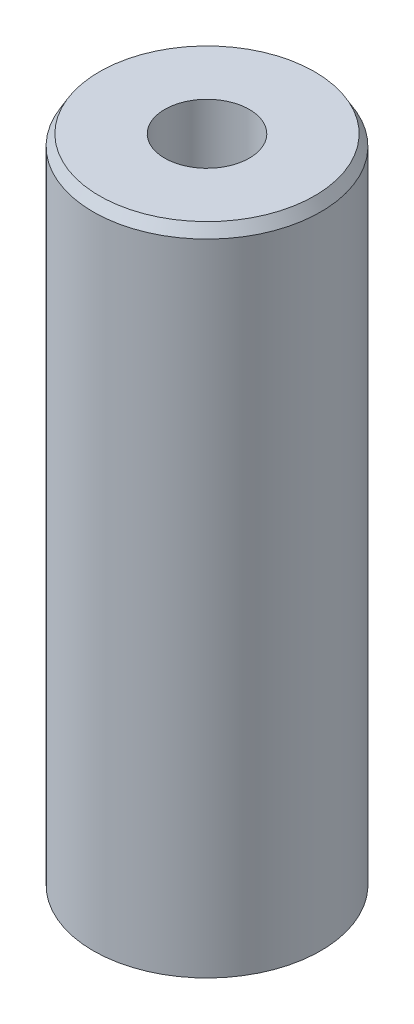
ISO-10303-21;
HEADER;
FILE_DESCRIPTION(('STEP AP214'),'2;1');
FILE_NAME('part.step','',(''),(''),'','','');
FILE_SCHEMA(('AUTOMOTIVE_DESIGN { 1 0 10303 214 1 1 1 1 }'));
ENDSEC;
DATA;
#1=APPLICATION_CONTEXT('core data for automotive mechanical design processes');
#2=APPLICATION_PROTOCOL_DEFINITION('international standard','automotive_design',2000,#1);
#3=PRODUCT_CONTEXT('',#1,'mechanical');
#4=PRODUCT('Part','Part','',(#3));
#5=PRODUCT_RELATED_PRODUCT_CATEGORY('part','',(#4));
#6=PRODUCT_DEFINITION_FORMATION('','',#4);
#7=PRODUCT_DEFINITION_CONTEXT('part definition',#1,'design');
#8=PRODUCT_DEFINITION('design','',#6,#7);
#9=PRODUCT_DEFINITION_SHAPE('','',#8);
#10=(LENGTH_UNIT() NAMED_UNIT(*) SI_UNIT(.MILLI.,.METRE.));
#11=(NAMED_UNIT(*) PLANE_ANGLE_UNIT() SI_UNIT($,.RADIAN.));
#12=(NAMED_UNIT(*) SI_UNIT($,.STERADIAN.) SOLID_ANGLE_UNIT());
#13=UNCERTAINTY_MEASURE_WITH_UNIT(LENGTH_MEASURE(1.E-05),#10,'distance_accuracy_value','');
#14=(GEOMETRIC_REPRESENTATION_CONTEXT(3) GLOBAL_UNCERTAINTY_ASSIGNED_CONTEXT((#13)) GLOBAL_UNIT_ASSIGNED_CONTEXT((#10,
#11,#12)) REPRESENTATION_CONTEXT('',''));
#15=CARTESIAN_POINT('',(0.,0.,0.));
#16=DIRECTION('',(0.,0.,1.));
#17=DIRECTION('',(1.,0.,0.));
#18=AXIS2_PLACEMENT_3D('',#15,#16,#17);
#19=CARTESIAN_POINT('',(0.,202.016611042001,0.));
#20=DIRECTION('',(0.,-1.,0.));
#21=DIRECTION('',(0.,0.,-1.));
#22=AXIS2_PLACEMENT_3D('',#19,#20,#21);
#23=CYLINDRICAL_SURFACE('',#22,35.);
#24=CARTESIAN_POINT('',(0.,198.705183530527,0.));
#25=DIRECTION('',(0.,1.,0.));
#26=DIRECTION('',(0.,0.,1.));
#27=AXIS2_PLACEMENT_3D('',#24,#25,#26);
#28=CIRCLE('',#27,35.);
#29=CARTESIAN_POINT('',(0.,198.705183530527,-35.));
#30=VERTEX_POINT('',#29);
#31=EDGE_CURVE('E50',#30,#30,#28,.F.);
#32=CARTESIAN_POINT('',(0.,1.91185356515172,0.));
#33=DIRECTION('',(0.,1.,0.));
#34=DIRECTION('',(0.,0.,1.));
#35=AXIS2_PLACEMENT_3D('',#32,#33,#34);
#36=CIRCLE('',#35,35.);
#37=CARTESIAN_POINT('',(0.,1.91185356515169,-35.));
#38=VERTEX_POINT('',#37);
#39=EDGE_CURVE('E51',#38,#38,#36,.T.);
#40=CARTESIAN_POINT('',(0.,198.705183530527,-35.));
#41=CARTESIAN_POINT('',(0.,196.655253010054,-35.));
#42=CARTESIAN_POINT('',(0.,194.605322489581,-35.));
#43=CARTESIAN_POINT('',(0.,190.505461448636,-35.));
#44=CARTESIAN_POINT('',(0.,188.455530928163,-35.));
#45=CARTESIAN_POINT('',(0.,184.355669887218,-35.));
#46=CARTESIAN_POINT('',(0.,182.305739366745,-35.));
#47=CARTESIAN_POINT('',(0.,178.2058783258,-35.));
#48=CARTESIAN_POINT('',(0.,176.155947805327,-35.));
#49=CARTESIAN_POINT('',(0.,172.056086764382,-35.));
#50=CARTESIAN_POINT('',(0.,170.006156243909,-35.));
#51=CARTESIAN_POINT('',(0.,165.906295202964,-35.));
#52=CARTESIAN_POINT('',(0.,163.856364682491,-35.));
#53=CARTESIAN_POINT('',(0.,159.756503641546,-35.));
#54=CARTESIAN_POINT('',(0.,157.706573121073,-35.));
#55=CARTESIAN_POINT('',(0.,153.606712080128,-35.));
#56=CARTESIAN_POINT('',(0.,151.556781559655,-35.));
#57=CARTESIAN_POINT('',(0.,147.45692051871,-35.));
#58=CARTESIAN_POINT('',(0.,145.406989998238,-35.));
#59=CARTESIAN_POINT('',(0.,141.307128957292,-35.));
#60=CARTESIAN_POINT('',(0.,139.25719843682,-35.));
#61=CARTESIAN_POINT('',(0.,135.157337395874,-35.));
#62=CARTESIAN_POINT('',(0.,133.107406875402,-35.));
#63=CARTESIAN_POINT('',(0.,129.007545834456,-35.));
#64=CARTESIAN_POINT('',(0.,126.957615313984,-35.));
#65=CARTESIAN_POINT('',(0.,122.857754273038,-35.));
#66=CARTESIAN_POINT('',(0.,120.807823752566,-35.));
#67=CARTESIAN_POINT('',(0.,116.70796271162,-35.));
#68=CARTESIAN_POINT('',(0.,114.658032191148,-35.));
#69=CARTESIAN_POINT('',(0.,110.558171150202,-35.));
#70=CARTESIAN_POINT('',(0.,108.50824062973,-35.));
#71=CARTESIAN_POINT('',(0.,104.408379588784,-35.));
#72=CARTESIAN_POINT('',(0.,102.358449068312,-35.));
#73=CARTESIAN_POINT('',(0.,98.2585880273665,-35.));
#74=CARTESIAN_POINT('',(0.,96.2086575068938,-35.));
#75=CARTESIAN_POINT('',(0.,92.1087964659485,-35.));
#76=CARTESIAN_POINT('',(0.,90.0588659454759,-35.));
#77=CARTESIAN_POINT('',(0.,85.9590049045306,-35.));
#78=CARTESIAN_POINT('',(0.,83.9090743840579,-35.));
#79=CARTESIAN_POINT('',(0.,79.8092133431126,-35.));
#80=CARTESIAN_POINT('',(0.,77.7592828226399,-35.));
#81=CARTESIAN_POINT('',(0.,73.6594217816946,-35.));
#82=CARTESIAN_POINT('',(0.,71.6094912612219,-35.));
#83=CARTESIAN_POINT('',(0.,67.5096302202766,-35.));
#84=CARTESIAN_POINT('',(0.,65.459699699804,-35.));
#85=CARTESIAN_POINT('',(0.,61.3598386588587,-35.));
#86=CARTESIAN_POINT('',(0.,59.309908138386,-35.));
#87=CARTESIAN_POINT('',(0.,55.2100470974407,-35.));
#88=CARTESIAN_POINT('',(0.,53.1601165769681,-35.));
#89=CARTESIAN_POINT('',(0.,49.0602555360228,-35.));
#90=CARTESIAN_POINT('',(0.,47.0103250155501,-35.));
#91=CARTESIAN_POINT('',(0.,42.9104639746048,-35.));
#92=CARTESIAN_POINT('',(0.,40.8605334541321,-35.));
#93=CARTESIAN_POINT('',(0.,36.7606724131868,-35.));
#94=CARTESIAN_POINT('',(0.,34.7107418927142,-35.));
#95=CARTESIAN_POINT('',(0.,30.6108808517689,-35.));
#96=CARTESIAN_POINT('',(0.,28.5609503312962,-35.));
#97=CARTESIAN_POINT('',(0.,24.4610892903509,-35.));
#98=CARTESIAN_POINT('',(0.,22.4111587698782,-35.));
#99=CARTESIAN_POINT('',(0.,18.3112977289329,-35.));
#100=CARTESIAN_POINT('',(0.,16.2613672084603,-35.));
#101=CARTESIAN_POINT('',(0.,12.161506167515,-35.));
#102=CARTESIAN_POINT('',(0.,10.1115756470423,-35.));
#103=CARTESIAN_POINT('',(0.,6.01171460609701,-35.));
#104=CARTESIAN_POINT('',(0.,3.96178408562435,-35.));
#105=CARTESIAN_POINT('',(0.,1.91185356515169,-35.));
#106=B_SPLINE_CURVE_WITH_KNOTS('',3,(#40,#41,#42,#43,#44,#45,#46,#47,#48,#49,#50,#51,#52,#53,
#54,#55,#56,#57,#58,#59,#60,#61,#62,#63,#64,#65,#66,#67,#68,#69,#70,#71,#72,#73,#74,#75,#76,#77,
#78,#79,#80,#81,#82,#83,#84,#85,#86,#87,#88,#89,#90,#91,#92,#93,#94,#95,#96,#97,#98,#99,#100,
#101,#102,#103,#104,#105),.UNSPECIFIED.,.F.,.F.,(4,2,2,2,2,2,2,2,2,2,2,2,2,2,2,2,2,2,2,2,2,2,2,
2,2,2,2,2,2,2,2,2,4),(0.,6.14979156141798,12.2995831228359,18.4493746842539,24.5991662456719,
30.7489578070898,36.8987493685078,43.0485409299258,49.1983324913437,55.3481240527617,
61.4979156141797,67.6477071755976,73.7974987370156,79.9472902984335,86.0970818598515,
92.2468734212695,98.3966649826874,104.546456544105,110.696248105523,116.846039666941,
122.995831228359,129.145622789777,135.295414351195,141.445205912613,147.594997474031,
153.744789035449,159.894580596867,166.044372158285,172.194163719703,178.343955281121,
184.493746842539,190.643538403957,196.793329965375),.UNSPECIFIED.);
#107=EDGE_CURVE('BSEAM39',#30,#38,#106,.T.);
#108=ORIENTED_EDGE('',*,*,#31,.T.);
#109=ORIENTED_EDGE('',*,*,#39,.T.);
#110=ORIENTED_EDGE('',*,*,#107,.T.);
#111=ORIENTED_EDGE('',*,*,#107,.F.);
#112=EDGE_LOOP('',(#108,#110,#109,#111));
#113=FACE_BOUND('',#112,.T.);
#114=ADVANCED_FACE('F39',(#113),#23,.T.);
#115=CARTESIAN_POINT('',(0.,202.016611042001,0.));
#116=DIRECTION('',(0.,1.,0.));
#117=DIRECTION('',(0.,0.,1.));
#118=AXIS2_PLACEMENT_3D('',#115,#116,#117);
#119=PLANE('',#118);
#120=CARTESIAN_POINT('',(0.,202.016611042001,0.));
#121=DIRECTION('',(0.,1.,0.));
#122=DIRECTION('',(0.,0.,1.));
#123=AXIS2_PLACEMENT_3D('',#120,#121,#122);
#124=CIRCLE('',#123,33.0881464348483);
#125=CARTESIAN_POINT('',(0.,202.016611042001,-33.0881464348483));
#126=VERTEX_POINT('',#125);
#127=EDGE_CURVE('E54',#126,#126,#124,.T.);
#128=ORIENTED_EDGE('',*,*,#127,.T.);
#129=EDGE_LOOP('',(#128));
#130=FACE_BOUND('',#129,.T.);
#131=CARTESIAN_POINT('',(0.,202.016611042001,0.));
#132=DIRECTION('',(0.,1.,0.));
#133=DIRECTION('',(0.,0.,1.));
#134=AXIS2_PLACEMENT_3D('',#131,#132,#133);
#135=CIRCLE('',#134,13.0093020095973);
#136=CARTESIAN_POINT('',(0.,202.016611042001,13.0093020095973));
#137=VERTEX_POINT('',#136);
#138=EDGE_CURVE('E58',#137,#137,#135,.T.);
#139=ORIENTED_EDGE('',*,*,#138,.F.);
#140=EDGE_LOOP('',(#139));
#141=FACE_BOUND('',#140,.T.);
#142=ADVANCED_FACE('F69',(#130,#141),#119,.T.);
#143=CARTESIAN_POINT('',(0.,0.,0.));
#144=DIRECTION('',(0.,1.,0.));
#145=DIRECTION('',(0.,0.,1.));
#146=AXIS2_PLACEMENT_3D('',#143,#144,#145);
#147=PLANE('',#146);
#148=CARTESIAN_POINT('',(0.,0.,0.));
#149=DIRECTION('',(0.,1.,0.));
#150=DIRECTION('',(0.,0.,1.));
#151=AXIS2_PLACEMENT_3D('',#148,#149,#150);
#152=CIRCLE('',#151,31.6885724885255);
#153=CARTESIAN_POINT('',(0.,0.,31.6885724885255));
#154=VERTEX_POINT('',#153);
#155=EDGE_CURVE('E10',#154,#154,#152,.F.);
#156=ORIENTED_EDGE('',*,*,#155,.T.);
#157=EDGE_LOOP('',(#156));
#158=FACE_BOUND('',#157,.T.);
#159=CARTESIAN_POINT('',(0.,0.,0.));
#160=DIRECTION('',(0.,1.,0.));
#161=DIRECTION('',(0.,0.,1.));
#162=AXIS2_PLACEMENT_3D('',#159,#160,#161);
#163=CIRCLE('',#162,13.0093020095973);
#164=CARTESIAN_POINT('',(0.,0.,13.0093020095973));
#165=VERTEX_POINT('',#164);
#166=EDGE_CURVE('E63',#165,#165,#163,.T.);
#167=ORIENTED_EDGE('',*,*,#166,.T.);
#168=EDGE_LOOP('',(#167));
#169=FACE_BOUND('',#168,.T.);
#170=ADVANCED_FACE('F75',(#158,#169),#147,.F.);
#171=CARTESIAN_POINT('',(0.,202.016611042001,0.));
#172=DIRECTION('',(0.,-1.,0.));
#173=DIRECTION('',(0.,0.,-1.));
#174=AXIS2_PLACEMENT_3D('',#171,#172,#173);
#175=CYLINDRICAL_SURFACE('',#174,13.0093020095973);
#176=ORIENTED_EDGE('',*,*,#138,.T.);
#177=EDGE_LOOP('',(#176));
#178=FACE_BOUND('',#177,.T.);
#179=ORIENTED_EDGE('',*,*,#166,.F.);
#180=EDGE_LOOP('',(#179));
#181=FACE_BOUND('',#180,.T.);
#182=ADVANCED_FACE('F70',(#178,#181),#175,.F.);
#183=CARTESIAN_POINT('',(0.,202.016611042001,0.));
#184=DIRECTION('',(0.,-1.,0.));
#185=DIRECTION('',(0.,0.,-1.));
#186=AXIS2_PLACEMENT_3D('',#183,#184,#185);
#187=CONICAL_SURFACE('',#186,33.0881464348483,0.523598775598291);
#188=CARTESIAN_POINT('',(0.,198.705183530527,-35.));
#189=CARTESIAN_POINT('',(0.,198.739677567104,-34.9800848586964));
#190=CARTESIAN_POINT('',(0.,198.774171603682,-34.9601697173927));
#191=CARTESIAN_POINT('',(0.,198.843159676838,-34.9203394347854));
#192=CARTESIAN_POINT('',(0.,198.877653713416,-34.9004242934817));
#193=CARTESIAN_POINT('',(0.,198.946641786572,-34.8605940108744));
#194=CARTESIAN_POINT('',(0.,198.981135823149,-34.8406788695707));
#195=CARTESIAN_POINT('',(0.,199.050123896305,-34.8008485869634));
#196=CARTESIAN_POINT('',(0.,199.084617932883,-34.7809334456597));
#197=CARTESIAN_POINT('',(0.,199.153606006039,-34.7411031630524));
#198=CARTESIAN_POINT('',(0.,199.188100042617,-34.7211880217487));
#199=CARTESIAN_POINT('',(0.,199.257088115772,-34.6813577391414));
#200=CARTESIAN_POINT('',(0.,199.29158215235,-34.6614425978377));
#201=CARTESIAN_POINT('',(0.,199.360570225506,-34.6216123152304));
#202=CARTESIAN_POINT('',(0.,199.395064262084,-34.6016971739268));
#203=CARTESIAN_POINT('',(0.,199.464052335239,-34.5618668913194));
#204=CARTESIAN_POINT('',(0.,199.498546371817,-34.5419517500158));
#205=CARTESIAN_POINT('',(0.,199.567534444973,-34.5021214674084));
#206=CARTESIAN_POINT('',(0.,199.602028481551,-34.4822063261048));
#207=CARTESIAN_POINT('',(0.,199.671016554707,-34.4423760434974));
#208=CARTESIAN_POINT('',(0.,199.705510591284,-34.4224609021938));
#209=CARTESIAN_POINT('',(0.,199.77449866444,-34.3826306195865));
#210=CARTESIAN_POINT('',(0.,199.808992701018,-34.3627154782828));
#211=CARTESIAN_POINT('',(0.,199.877980774174,-34.3228851956755));
#212=CARTESIAN_POINT('',(0.,199.912474810752,-34.3029700543718));
#213=CARTESIAN_POINT('',(0.,199.981462883907,-34.2631397717645));
#214=CARTESIAN_POINT('',(0.,200.015956920485,-34.2432246304608));
#215=CARTESIAN_POINT('',(0.,200.084944993641,-34.2033943478535));
#216=CARTESIAN_POINT('',(0.,200.119439030219,-34.1834792065498));
#217=CARTESIAN_POINT('',(0.,200.188427103374,-34.1436489239425));
#218=CARTESIAN_POINT('',(0.,200.222921139952,-34.1237337826388));
#219=CARTESIAN_POINT('',(0.,200.291909213108,-34.0839035000315));
#220=CARTESIAN_POINT('',(0.,200.326403249686,-34.0639883587278));
#221=CARTESIAN_POINT('',(0.,200.395391322842,-34.0241580761205));
#222=CARTESIAN_POINT('',(0.,200.42988535942,-34.0042429348169));
#223=CARTESIAN_POINT('',(0.,200.498873432575,-33.9644126522095));
#224=CARTESIAN_POINT('',(0.,200.533367469153,-33.9444975109059));
#225=CARTESIAN_POINT('',(0.,200.602355542309,-33.9046672282985));
#226=CARTESIAN_POINT('',(0.,200.636849578887,-33.8847520869949));
#227=CARTESIAN_POINT('',(0.,200.705837652042,-33.8449218043875));
#228=CARTESIAN_POINT('',(0.,200.74033168862,-33.8250066630839));
#229=CARTESIAN_POINT('',(0.,200.809319761776,-33.7851763804765));
#230=CARTESIAN_POINT('',(0.,200.843813798354,-33.7652612391729));
#231=CARTESIAN_POINT('',(0.,200.91280187151,-33.7254309565656));
#232=CARTESIAN_POINT('',(0.,200.947295908087,-33.7055158152619));
#233=CARTESIAN_POINT('',(0.,201.016283981243,-33.6656855326546));
#234=CARTESIAN_POINT('',(0.,201.050778017821,-33.6457703913509));
#235=CARTESIAN_POINT('',(0.,201.119766090977,-33.6059401087436));
#236=CARTESIAN_POINT('',(0.,201.154260127555,-33.5860249674399));
#237=CARTESIAN_POINT('',(0.,201.22324820071,-33.5461946848326));
#238=CARTESIAN_POINT('',(0.,201.257742237288,-33.5262795435289));
#239=CARTESIAN_POINT('',(0.,201.326730310444,-33.4864492609216));
#240=CARTESIAN_POINT('',(0.,201.361224347022,-33.4665341196179));
#241=CARTESIAN_POINT('',(0.,201.430212420177,-33.4267038370106));
#242=CARTESIAN_POINT('',(0.,201.464706456755,-33.4067886957069));
#243=CARTESIAN_POINT('',(0.,201.533694529911,-33.3669584130996));
#244=CARTESIAN_POINT('',(0.,201.568188566489,-33.347043271796));
#245=CARTESIAN_POINT('',(0.,201.637176639645,-33.3072129891886));
#246=CARTESIAN_POINT('',(0.,201.671670676222,-33.287297847885));
#247=CARTESIAN_POINT('',(0.,201.740658749378,-33.2474675652776));
#248=CARTESIAN_POINT('',(0.,201.775152785956,-33.227552423974));
#249=CARTESIAN_POINT('',(0.,201.844140859112,-33.1877221413666));
#250=CARTESIAN_POINT('',(0.,201.87863489569,-33.167807000063));
#251=CARTESIAN_POINT('',(0.,201.947622968845,-33.1279767174557));
#252=CARTESIAN_POINT('',(0.,201.982117005423,-33.108061576152));
#253=CARTESIAN_POINT('',(0.,202.016611042001,-33.0881464348483));
#254=B_SPLINE_CURVE_WITH_KNOTS('',3,(#188,#189,#190,#191,#192,#193,#194,#195,#196,#197,#198,
#199,#200,#201,#202,#203,#204,#205,#206,#207,#208,#209,#210,#211,#212,#213,#214,#215,#216,#217,
#218,#219,#220,#221,#222,#223,#224,#225,#226,#227,#228,#229,#230,#231,#232,#233,#234,#235,#236,
#237,#238,#239,#240,#241,#242,#243,#244,#245,#246,#247,#248,#249,#250,#251,#252,#253),
.UNSPECIFIED.,.F.,.F.,(4,2,2,2,2,2,2,2,2,2,2,2,2,2,2,2,2,2,2,2,2,2,2,2,2,2,2,2,2,2,2,2,4),(0.,
0.119490847822001,0.238981695643977,0.358472543465954,0.47796339128793,0.597454239109931,
0.716945086931908,0.836435934753884,0.955926782575861,1.07541763039784,1.19490847821984,
1.31439932604182,1.43389017386379,1.55338102168577,1.67287186950777,1.79236271732975,
1.91185356515172,2.0313444129737,2.15083526079568,2.27032610861768,2.38981695643966,
2.50930780426163,2.62879865208361,2.74828949990561,2.86778034772759,2.98727119554956,
3.10676204337154,3.22625289119352,3.34574373901552,3.4652345868375,3.58472543465948,
3.70421628248145,3.82370713030345),.UNSPECIFIED.);
#255=EDGE_CURVE('BSEAM81',#30,#126,#254,.T.);
#256=ORIENTED_EDGE('',*,*,#31,.F.);
#257=ORIENTED_EDGE('',*,*,#127,.F.);
#258=ORIENTED_EDGE('',*,*,#255,.T.);
#259=ORIENTED_EDGE('',*,*,#255,.F.);
#260=EDGE_LOOP('',(#256,#258,#257,#259));
#261=FACE_BOUND('',#260,.T.);
#262=ADVANCED_FACE('F81',(#261),#187,.T.);
#263=CARTESIAN_POINT('',(0.,1.91185356515172,0.));
#264=DIRECTION('',(0.,1.,0.));
#265=DIRECTION('',(0.,0.,1.));
#266=AXIS2_PLACEMENT_3D('',#263,#264,#265);
#267=CONICAL_SURFACE('',#266,35.,1.0471975511966);
#268=ORIENTED_EDGE('',*,*,#155,.F.);
#269=EDGE_LOOP('',(#268));
#270=FACE_BOUND('',#269,.T.);
#271=ORIENTED_EDGE('',*,*,#39,.F.);
#272=EDGE_LOOP('',(#271));
#273=FACE_BOUND('',#272,.T.);
#274=ADVANCED_FACE('F45',(#270,#273),#267,.T.);
#275=CLOSED_SHELL('',(#114,#142,#170,#182,#262,#274));
#276=MANIFOLD_SOLID_BREP('B2',#275);
#277=ADVANCED_BREP_SHAPE_REPRESENTATION('',(#18,#276),#14);
#278=SHAPE_DEFINITION_REPRESENTATION(#9,#277);
ENDSEC;
END-ISO-10303-21;
